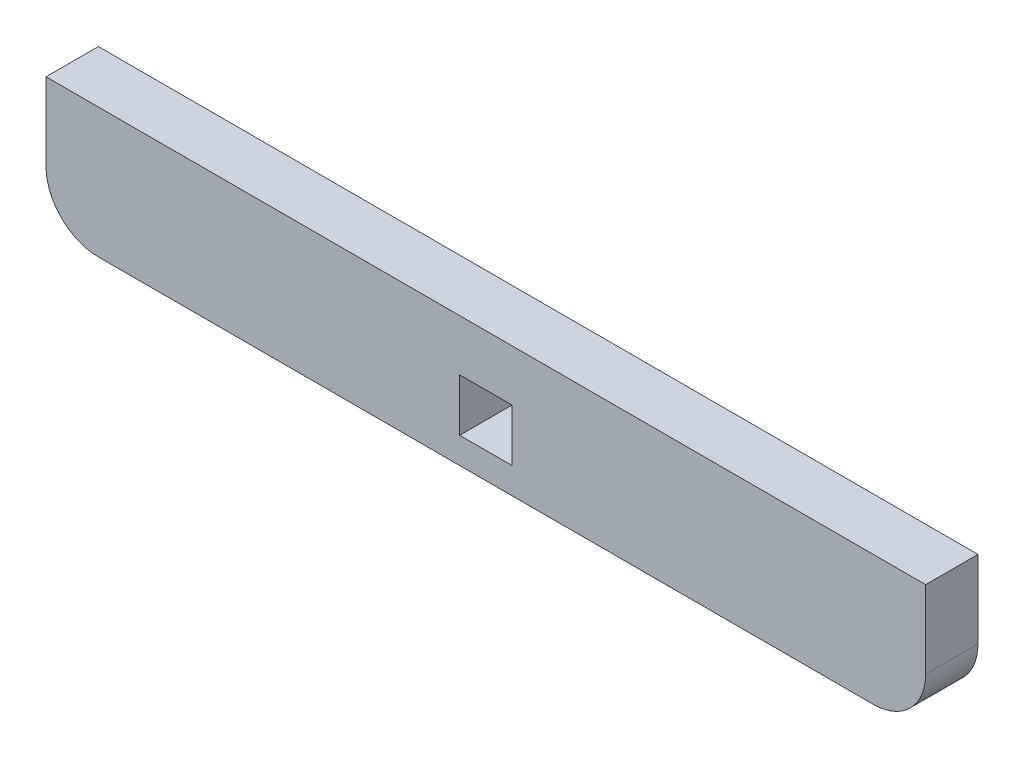
ISO-10303-21;
HEADER;
FILE_DESCRIPTION(('STEP AP214'),'2;1');
FILE_NAME('part.step','',(''),(''),'','','');
FILE_SCHEMA(('AUTOMOTIVE_DESIGN { 1 0 10303 214 1 1 1 1 }'));
ENDSEC;
DATA;
#1=APPLICATION_CONTEXT('core data for automotive mechanical design processes');
#2=APPLICATION_PROTOCOL_DEFINITION('international standard','automotive_design',2000,#1);
#3=PRODUCT_CONTEXT('',#1,'mechanical');
#4=PRODUCT('Part','Part','',(#3));
#5=PRODUCT_RELATED_PRODUCT_CATEGORY('part','',(#4));
#6=PRODUCT_DEFINITION_FORMATION('','',#4);
#7=PRODUCT_DEFINITION_CONTEXT('part definition',#1,'design');
#8=PRODUCT_DEFINITION('design','',#6,#7);
#9=PRODUCT_DEFINITION_SHAPE('','',#8);
#10=(LENGTH_UNIT() NAMED_UNIT(*) SI_UNIT(.MILLI.,.METRE.));
#11=(NAMED_UNIT(*) PLANE_ANGLE_UNIT() SI_UNIT($,.RADIAN.));
#12=(NAMED_UNIT(*) SI_UNIT($,.STERADIAN.) SOLID_ANGLE_UNIT());
#13=UNCERTAINTY_MEASURE_WITH_UNIT(LENGTH_MEASURE(1.E-05),#10,'distance_accuracy_value','');
#14=(GEOMETRIC_REPRESENTATION_CONTEXT(3) GLOBAL_UNCERTAINTY_ASSIGNED_CONTEXT((#13)) GLOBAL_UNIT_ASSIGNED_CONTEXT((#10,
#11,#12)) REPRESENTATION_CONTEXT('',''));
#15=CARTESIAN_POINT('',(0.,0.,0.));
#16=DIRECTION('',(0.,0.,1.));
#17=DIRECTION('',(1.,0.,0.));
#18=AXIS2_PLACEMENT_3D('',#15,#16,#17);
#19=CARTESIAN_POINT('',(60.325,-6.98499999999997,3.175));
#20=DIRECTION('',(0.,0.,-1.));
#21=DIRECTION('',(-1.,0.,0.));
#22=AXIS2_PLACEMENT_3D('',#19,#20,#21);
#23=PLANE('',#22);
#24=CARTESIAN_POINT('',(60.325,-6.98499999999997,3.175));
#25=DIRECTION('',(0.,0.,-1.));
#26=DIRECTION('',(-1.,0.,0.));
#27=AXIS2_PLACEMENT_3D('',#24,#25,#26);
#28=CIRCLE('',#27,3.175);
#29=CARTESIAN_POINT('',(63.5,-6.98499999999995,3.175));
#30=VERTEX_POINT('',#29);
#31=CARTESIAN_POINT('',(60.325,-10.16,3.175));
#32=VERTEX_POINT('',#31);
#33=EDGE_CURVE('E177',#30,#32,#28,.T.);
#34=ORIENTED_EDGE('',*,*,#33,.F.);
#35=DIRECTION('',(0.,-1.,0.));
#36=VECTOR('',#35,1.);
#37=CARTESIAN_POINT('',(63.5,-2.28599999999998,3.175));
#38=LINE('',#37,#36);
#39=CARTESIAN_POINT('',(63.5,-2.28599999999998,3.175));
#40=VERTEX_POINT('',#39);
#41=EDGE_CURVE('E193',#40,#30,#38,.T.);
#42=ORIENTED_EDGE('',*,*,#41,.F.);
#43=DIRECTION('',(1.,0.,0.));
#44=VECTOR('',#43,1.);
#45=CARTESIAN_POINT('',(10.16,-2.28599999999998,3.175));
#46=LINE('',#45,#44);
#47=CARTESIAN_POINT('',(10.16,-2.28599999999998,3.175));
#48=VERTEX_POINT('',#47);
#49=EDGE_CURVE('E190',#48,#40,#46,.T.);
#50=ORIENTED_EDGE('',*,*,#49,.F.);
#51=DIRECTION('',(0.,1.,0.));
#52=VECTOR('',#51,1.);
#53=CARTESIAN_POINT('',(10.16,-6.98499999999998,3.175));
#54=LINE('',#53,#52);
#55=CARTESIAN_POINT('',(10.16,-6.98499999999998,3.175));
#56=VERTEX_POINT('',#55);
#57=EDGE_CURVE('E187',#56,#48,#54,.T.);
#58=ORIENTED_EDGE('',*,*,#57,.F.);
#59=CARTESIAN_POINT('',(13.335,-6.98499999999998,3.175));
#60=DIRECTION('',(0.,0.,-1.));
#61=DIRECTION('',(-1.,0.,0.));
#62=AXIS2_PLACEMENT_3D('',#59,#60,#61);
#63=CIRCLE('',#62,3.175);
#64=CARTESIAN_POINT('',(13.335,-10.16,3.175));
#65=VERTEX_POINT('',#64);
#66=EDGE_CURVE('E184',#65,#56,#63,.T.);
#67=ORIENTED_EDGE('',*,*,#66,.F.);
#68=DIRECTION('',(-1.,0.,0.));
#69=VECTOR('',#68,1.);
#70=CARTESIAN_POINT('',(60.325,-10.16,3.175));
#71=LINE('',#70,#69);
#72=EDGE_CURVE('E180',#32,#65,#71,.T.);
#73=ORIENTED_EDGE('',*,*,#72,.F.);
#74=EDGE_LOOP('',(#34,#42,#50,#58,#67,#73));
#75=FACE_BOUND('',#74,.T.);
#76=DIRECTION('',(-1.,0.,0.));
#77=VECTOR('',#76,1.);
#78=CARTESIAN_POINT('',(38.4175,-5.39749999999997,3.175));
#79=LINE('',#78,#77);
#80=CARTESIAN_POINT('',(38.4175,-5.39749999999997,3.175));
#81=VERTEX_POINT('',#80);
#82=CARTESIAN_POINT('',(35.2425,-5.39749999999997,3.175));
#83=VERTEX_POINT('',#82);
#84=EDGE_CURVE('E141',#81,#83,#79,.T.);
#85=ORIENTED_EDGE('',*,*,#84,.F.);
#86=DIRECTION('',(0.,1.,0.));
#87=VECTOR('',#86,1.);
#88=CARTESIAN_POINT('',(38.4175,-8.57249999999997,3.175));
#89=LINE('',#88,#87);
#90=CARTESIAN_POINT('',(38.4175,-8.57249999999997,3.175));
#91=VERTEX_POINT('',#90);
#92=EDGE_CURVE('E163',#91,#81,#89,.T.);
#93=ORIENTED_EDGE('',*,*,#92,.F.);
#94=DIRECTION('',(1.,0.,0.));
#95=VECTOR('',#94,1.);
#96=CARTESIAN_POINT('',(35.2425,-8.57249999999997,3.175));
#97=LINE('',#96,#95);
#98=CARTESIAN_POINT('',(35.2425,-8.57249999999997,3.175));
#99=VERTEX_POINT('',#98);
#100=EDGE_CURVE('E161',#99,#91,#97,.T.);
#101=ORIENTED_EDGE('',*,*,#100,.F.);
#102=DIRECTION('',(0.,-1.,0.));
#103=VECTOR('',#102,1.);
#104=CARTESIAN_POINT('',(35.2425,-5.39749999999997,3.175));
#105=LINE('',#104,#103);
#106=EDGE_CURVE('E149',#83,#99,#105,.T.);
#107=ORIENTED_EDGE('',*,*,#106,.F.);
#108=EDGE_LOOP('',(#85,#93,#101,#107));
#109=FACE_BOUND('',#108,.T.);
#110=ADVANCED_FACE('F63',(#75,#109),#23,.F.);
#111=CARTESIAN_POINT('',(60.325,-6.98499999999997,0.));
#112=DIRECTION('',(0.,0.,-1.));
#113=DIRECTION('',(-1.,0.,0.));
#114=AXIS2_PLACEMENT_3D('',#111,#112,#113);
#115=PLANE('',#114);
#116=CARTESIAN_POINT('',(60.325,-6.98499999999997,0.));
#117=DIRECTION('',(0.,0.,-1.));
#118=DIRECTION('',(-1.,0.,0.));
#119=AXIS2_PLACEMENT_3D('',#116,#117,#118);
#120=CIRCLE('',#119,3.175);
#121=CARTESIAN_POINT('',(63.5,-6.98499999999995,0.));
#122=VERTEX_POINT('',#121);
#123=CARTESIAN_POINT('',(60.325,-10.16,0.));
#124=VERTEX_POINT('',#123);
#125=EDGE_CURVE('E157',#122,#124,#120,.T.);
#126=ORIENTED_EDGE('',*,*,#125,.T.);
#127=DIRECTION('',(-1.,0.,0.));
#128=VECTOR('',#127,1.);
#129=CARTESIAN_POINT('',(60.325,-10.16,0.));
#130=LINE('',#129,#128);
#131=CARTESIAN_POINT('',(13.335,-10.16,0.));
#132=VERTEX_POINT('',#131);
#133=EDGE_CURVE('E198',#124,#132,#130,.T.);
#134=ORIENTED_EDGE('',*,*,#133,.T.);
#135=CARTESIAN_POINT('',(13.335,-6.98499999999998,0.));
#136=DIRECTION('',(0.,0.,-1.));
#137=DIRECTION('',(-1.,0.,0.));
#138=AXIS2_PLACEMENT_3D('',#135,#136,#137);
#139=CIRCLE('',#138,3.175);
#140=CARTESIAN_POINT('',(10.16,-6.98499999999998,0.));
#141=VERTEX_POINT('',#140);
#142=EDGE_CURVE('E201',#132,#141,#139,.T.);
#143=ORIENTED_EDGE('',*,*,#142,.T.);
#144=DIRECTION('',(0.,1.,0.));
#145=VECTOR('',#144,1.);
#146=CARTESIAN_POINT('',(10.16,-6.98499999999998,0.));
#147=LINE('',#146,#145);
#148=CARTESIAN_POINT('',(10.16,-2.28599999999998,0.));
#149=VERTEX_POINT('',#148);
#150=EDGE_CURVE('E204',#141,#149,#147,.T.);
#151=ORIENTED_EDGE('',*,*,#150,.T.);
#152=DIRECTION('',(1.,0.,0.));
#153=VECTOR('',#152,1.);
#154=CARTESIAN_POINT('',(10.16,-2.28599999999998,0.));
#155=LINE('',#154,#153);
#156=CARTESIAN_POINT('',(63.5,-2.28599999999998,0.));
#157=VERTEX_POINT('',#156);
#158=EDGE_CURVE('E207',#149,#157,#155,.T.);
#159=ORIENTED_EDGE('',*,*,#158,.T.);
#160=DIRECTION('',(0.,-1.,0.));
#161=VECTOR('',#160,1.);
#162=CARTESIAN_POINT('',(63.5,-2.28599999999998,0.));
#163=LINE('',#162,#161);
#164=EDGE_CURVE('E181',#157,#122,#163,.T.);
#165=ORIENTED_EDGE('',*,*,#164,.T.);
#166=EDGE_LOOP('',(#126,#134,#143,#151,#159,#165));
#167=FACE_BOUND('',#166,.T.);
#168=DIRECTION('',(0.,1.,0.));
#169=VECTOR('',#168,1.);
#170=CARTESIAN_POINT('',(38.4175,-8.57249999999997,0.));
#171=LINE('',#170,#169);
#172=CARTESIAN_POINT('',(38.4175,-8.57249999999997,0.));
#173=VERTEX_POINT('',#172);
#174=CARTESIAN_POINT('',(38.4175,-5.39749999999997,0.));
#175=VERTEX_POINT('',#174);
#176=EDGE_CURVE('E150',#173,#175,#171,.T.);
#177=ORIENTED_EDGE('',*,*,#176,.T.);
#178=DIRECTION('',(-1.,0.,0.));
#179=VECTOR('',#178,1.);
#180=CARTESIAN_POINT('',(38.4175,-5.39749999999997,0.));
#181=LINE('',#180,#179);
#182=CARTESIAN_POINT('',(35.2425,-5.39749999999997,0.));
#183=VERTEX_POINT('',#182);
#184=EDGE_CURVE('E88',#175,#183,#181,.T.);
#185=ORIENTED_EDGE('',*,*,#184,.T.);
#186=DIRECTION('',(0.,-1.,0.));
#187=VECTOR('',#186,1.);
#188=CARTESIAN_POINT('',(35.2425,-5.39749999999997,0.));
#189=LINE('',#188,#187);
#190=CARTESIAN_POINT('',(35.2425,-8.57249999999997,0.));
#191=VERTEX_POINT('',#190);
#192=EDGE_CURVE('E156',#183,#191,#189,.T.);
#193=ORIENTED_EDGE('',*,*,#192,.T.);
#194=DIRECTION('',(1.,0.,0.));
#195=VECTOR('',#194,1.);
#196=CARTESIAN_POINT('',(35.2425,-8.57249999999997,0.));
#197=LINE('',#196,#195);
#198=EDGE_CURVE('E169',#191,#173,#197,.T.);
#199=ORIENTED_EDGE('',*,*,#198,.T.);
#200=EDGE_LOOP('',(#177,#185,#193,#199));
#201=FACE_BOUND('',#200,.T.);
#202=ADVANCED_FACE('F226',(#167,#201),#115,.T.);
#203=CARTESIAN_POINT('',(60.325,-6.98499999999997,3.175));
#204=DIRECTION('',(0.,0.,-1.));
#205=DIRECTION('',(-1.,0.,0.));
#206=AXIS2_PLACEMENT_3D('',#203,#204,#205);
#207=CYLINDRICAL_SURFACE('',#206,3.175);
#208=ORIENTED_EDGE('',*,*,#125,.F.);
#209=DIRECTION('',(0.,0.,-1.));
#210=VECTOR('',#209,1.);
#211=CARTESIAN_POINT('',(63.5,-6.98499999999995,3.175));
#212=LINE('',#211,#210);
#213=EDGE_CURVE('E12',#30,#122,#212,.T.);
#214=ORIENTED_EDGE('',*,*,#213,.F.);
#215=ORIENTED_EDGE('',*,*,#33,.T.);
#216=DIRECTION('',(0.,0.,-1.));
#217=VECTOR('',#216,1.);
#218=CARTESIAN_POINT('',(60.325,-10.16,3.175));
#219=LINE('',#218,#217);
#220=EDGE_CURVE('E67',#32,#124,#219,.T.);
#221=ORIENTED_EDGE('',*,*,#220,.T.);
#222=EDGE_LOOP('',(#208,#214,#215,#221));
#223=FACE_BOUND('',#222,.T.);
#224=ADVANCED_FACE('F65',(#223),#207,.T.);
#225=CARTESIAN_POINT('',(63.5,-2.28599999999998,3.175));
#226=DIRECTION('',(1.,0.,0.));
#227=DIRECTION('',(0.,0.,-1.));
#228=AXIS2_PLACEMENT_3D('',#225,#226,#227);
#229=PLANE('',#228);
#230=ORIENTED_EDGE('',*,*,#164,.F.);
#231=DIRECTION('',(0.,0.,-1.));
#232=VECTOR('',#231,1.);
#233=CARTESIAN_POINT('',(63.5,-2.28599999999998,3.175));
#234=LINE('',#233,#232);
#235=EDGE_CURVE('E72',#40,#157,#234,.T.);
#236=ORIENTED_EDGE('',*,*,#235,.F.);
#237=ORIENTED_EDGE('',*,*,#41,.T.);
#238=ORIENTED_EDGE('',*,*,#213,.T.);
#239=EDGE_LOOP('',(#230,#236,#237,#238));
#240=FACE_BOUND('',#239,.T.);
#241=ADVANCED_FACE('F231',(#240),#229,.T.);
#242=CARTESIAN_POINT('',(10.16,-2.28599999999998,3.175));
#243=DIRECTION('',(0.,1.,0.));
#244=DIRECTION('',(-1.,0.,0.));
#245=AXIS2_PLACEMENT_3D('',#242,#243,#244);
#246=PLANE('',#245);
#247=ORIENTED_EDGE('',*,*,#158,.F.);
#248=DIRECTION('',(0.,0.,-1.));
#249=VECTOR('',#248,1.);
#250=CARTESIAN_POINT('',(10.16,-2.28599999999998,3.175));
#251=LINE('',#250,#249);
#252=EDGE_CURVE('E213',#48,#149,#251,.T.);
#253=ORIENTED_EDGE('',*,*,#252,.F.);
#254=ORIENTED_EDGE('',*,*,#49,.T.);
#255=ORIENTED_EDGE('',*,*,#235,.T.);
#256=EDGE_LOOP('',(#247,#253,#254,#255));
#257=FACE_BOUND('',#256,.T.);
#258=ADVANCED_FACE('F243',(#257),#246,.T.);
#259=CARTESIAN_POINT('',(10.16,-6.98499999999998,3.175));
#260=DIRECTION('',(-1.,0.,0.));
#261=DIRECTION('',(0.,0.,1.));
#262=AXIS2_PLACEMENT_3D('',#259,#260,#261);
#263=PLANE('',#262);
#264=ORIENTED_EDGE('',*,*,#150,.F.);
#265=DIRECTION('',(0.,0.,-1.));
#266=VECTOR('',#265,1.);
#267=CARTESIAN_POINT('',(10.16,-6.98499999999998,3.175));
#268=LINE('',#267,#266);
#269=EDGE_CURVE('E215',#56,#141,#268,.T.);
#270=ORIENTED_EDGE('',*,*,#269,.F.);
#271=ORIENTED_EDGE('',*,*,#57,.T.);
#272=ORIENTED_EDGE('',*,*,#252,.T.);
#273=EDGE_LOOP('',(#264,#270,#271,#272));
#274=FACE_BOUND('',#273,.T.);
#275=ADVANCED_FACE('F241',(#274),#263,.T.);
#276=CARTESIAN_POINT('',(13.335,-6.98499999999998,3.175));
#277=DIRECTION('',(0.,0.,-1.));
#278=DIRECTION('',(-1.,0.,0.));
#279=AXIS2_PLACEMENT_3D('',#276,#277,#278);
#280=CYLINDRICAL_SURFACE('',#279,3.175);
#281=ORIENTED_EDGE('',*,*,#142,.F.);
#282=DIRECTION('',(0.,0.,-1.));
#283=VECTOR('',#282,1.);
#284=CARTESIAN_POINT('',(13.335,-10.16,3.175));
#285=LINE('',#284,#283);
#286=EDGE_CURVE('E216',#65,#132,#285,.T.);
#287=ORIENTED_EDGE('',*,*,#286,.F.);
#288=ORIENTED_EDGE('',*,*,#66,.T.);
#289=ORIENTED_EDGE('',*,*,#269,.T.);
#290=EDGE_LOOP('',(#281,#287,#288,#289));
#291=FACE_BOUND('',#290,.T.);
#292=ADVANCED_FACE('F238',(#291),#280,.T.);
#293=CARTESIAN_POINT('',(60.325,-10.16,3.175));
#294=DIRECTION('',(0.,-1.,0.));
#295=DIRECTION('',(1.,0.,0.));
#296=AXIS2_PLACEMENT_3D('',#293,#294,#295);
#297=PLANE('',#296);
#298=ORIENTED_EDGE('',*,*,#133,.F.);
#299=ORIENTED_EDGE('',*,*,#220,.F.);
#300=ORIENTED_EDGE('',*,*,#72,.T.);
#301=ORIENTED_EDGE('',*,*,#286,.T.);
#302=EDGE_LOOP('',(#298,#299,#300,#301));
#303=FACE_BOUND('',#302,.T.);
#304=ADVANCED_FACE('F224',(#303),#297,.T.);
#305=CARTESIAN_POINT('',(38.4175,-5.39749999999997,3.175));
#306=DIRECTION('',(0.,-1.,0.));
#307=DIRECTION('',(1.,0.,0.));
#308=AXIS2_PLACEMENT_3D('',#305,#306,#307);
#309=PLANE('',#308);
#310=ORIENTED_EDGE('',*,*,#184,.F.);
#311=DIRECTION('',(0.,0.,-1.));
#312=VECTOR('',#311,1.);
#313=CARTESIAN_POINT('',(38.4175,-5.39749999999997,3.175));
#314=LINE('',#313,#312);
#315=EDGE_CURVE('E145',#81,#175,#314,.T.);
#316=ORIENTED_EDGE('',*,*,#315,.F.);
#317=ORIENTED_EDGE('',*,*,#84,.T.);
#318=DIRECTION('',(0.,0.,-1.));
#319=VECTOR('',#318,1.);
#320=CARTESIAN_POINT('',(35.2425,-5.39749999999997,3.175));
#321=LINE('',#320,#319);
#322=EDGE_CURVE('E144',#83,#183,#321,.T.);
#323=ORIENTED_EDGE('',*,*,#322,.T.);
#324=EDGE_LOOP('',(#310,#316,#317,#323));
#325=FACE_BOUND('',#324,.T.);
#326=ADVANCED_FACE('F143',(#325),#309,.T.);
#327=CARTESIAN_POINT('',(35.2425,-5.39749999999997,3.175));
#328=DIRECTION('',(1.,0.,0.));
#329=DIRECTION('',(0.,0.,-1.));
#330=AXIS2_PLACEMENT_3D('',#327,#328,#329);
#331=PLANE('',#330);
#332=ORIENTED_EDGE('',*,*,#192,.F.);
#333=ORIENTED_EDGE('',*,*,#322,.F.);
#334=ORIENTED_EDGE('',*,*,#106,.T.);
#335=DIRECTION('',(0.,0.,-1.));
#336=VECTOR('',#335,1.);
#337=CARTESIAN_POINT('',(35.2425,-8.57249999999997,3.175));
#338=LINE('',#337,#336);
#339=EDGE_CURVE('E158',#99,#191,#338,.T.);
#340=ORIENTED_EDGE('',*,*,#339,.T.);
#341=EDGE_LOOP('',(#332,#333,#334,#340));
#342=FACE_BOUND('',#341,.T.);
#343=ADVANCED_FACE('F153',(#342),#331,.T.);
#344=CARTESIAN_POINT('',(35.2425,-8.57249999999997,3.175));
#345=DIRECTION('',(0.,1.,0.));
#346=DIRECTION('',(0.,0.,1.));
#347=AXIS2_PLACEMENT_3D('',#344,#345,#346);
#348=PLANE('',#347);
#349=ORIENTED_EDGE('',*,*,#198,.F.);
#350=ORIENTED_EDGE('',*,*,#339,.F.);
#351=ORIENTED_EDGE('',*,*,#100,.T.);
#352=DIRECTION('',(0.,0.,-1.));
#353=VECTOR('',#352,1.);
#354=CARTESIAN_POINT('',(38.4175,-8.57249999999997,3.175));
#355=LINE('',#354,#353);
#356=EDGE_CURVE('E80',#91,#173,#355,.T.);
#357=ORIENTED_EDGE('',*,*,#356,.T.);
#358=EDGE_LOOP('',(#349,#350,#351,#357));
#359=FACE_BOUND('',#358,.T.);
#360=ADVANCED_FACE('F263',(#359),#348,.T.);
#361=CARTESIAN_POINT('',(38.4175,-8.57249999999997,3.175));
#362=DIRECTION('',(-1.,0.,0.));
#363=DIRECTION('',(0.,0.,1.));
#364=AXIS2_PLACEMENT_3D('',#361,#362,#363);
#365=PLANE('',#364);
#366=ORIENTED_EDGE('',*,*,#176,.F.);
#367=ORIENTED_EDGE('',*,*,#356,.F.);
#368=ORIENTED_EDGE('',*,*,#92,.T.);
#369=ORIENTED_EDGE('',*,*,#315,.T.);
#370=EDGE_LOOP('',(#366,#367,#368,#369));
#371=FACE_BOUND('',#370,.T.);
#372=ADVANCED_FACE('F266',(#371),#365,.T.);
#373=CLOSED_SHELL('',(#110,#202,#224,#241,#258,#275,#292,#304,#326,#343,#360,#372));
#374=MANIFOLD_SOLID_BREP('B2',#373);
#375=ADVANCED_BREP_SHAPE_REPRESENTATION('',(#18,#374),#14);
#376=SHAPE_DEFINITION_REPRESENTATION(#9,#375);
ENDSEC;
END-ISO-10303-21;
